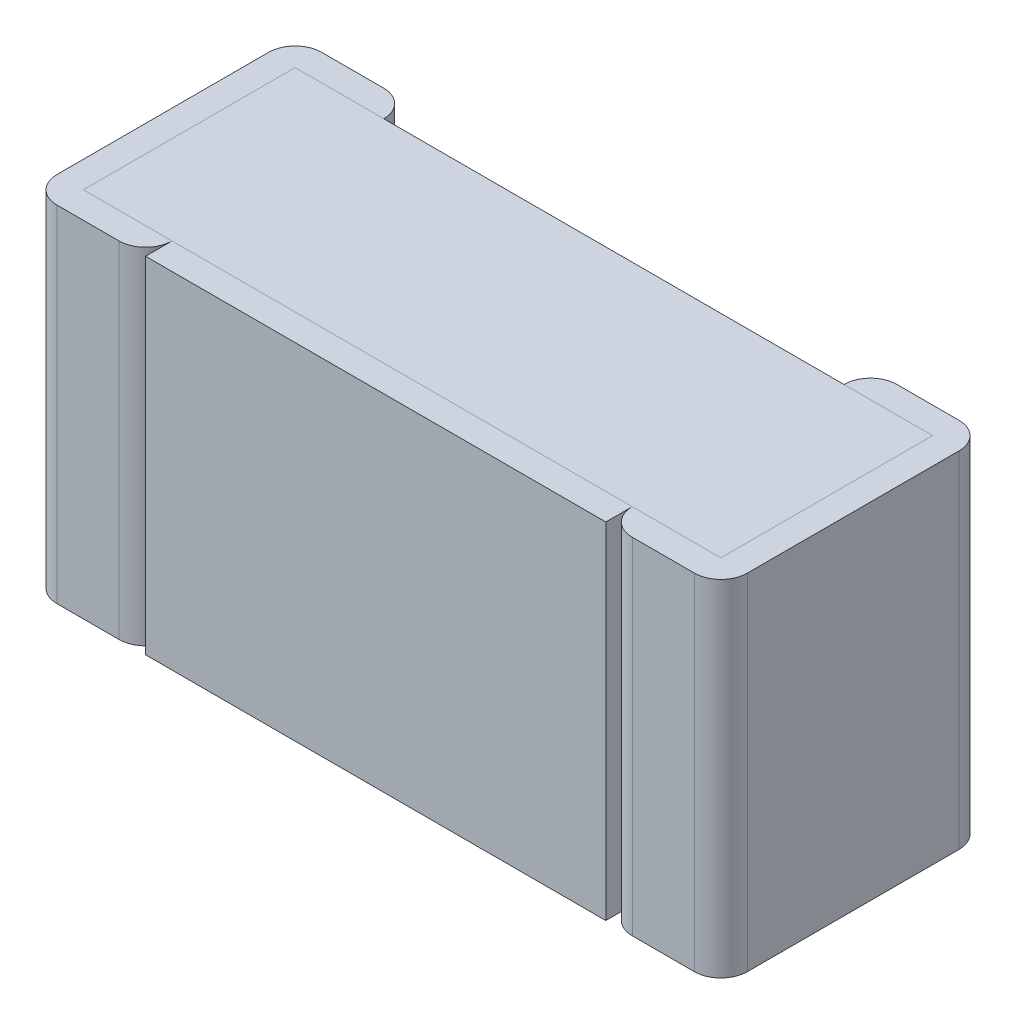
ISO-10303-21;
HEADER;
FILE_DESCRIPTION(('STEP AP214'),'2;1');
FILE_NAME('part.step','',(''),(''),'','','');
FILE_SCHEMA(('AUTOMOTIVE_DESIGN { 1 0 10303 214 1 1 1 1 }'));
ENDSEC;
DATA;
#1=APPLICATION_CONTEXT('core data for automotive mechanical design processes');
#2=APPLICATION_PROTOCOL_DEFINITION('international standard','automotive_design',2000,#1);
#3=PRODUCT_CONTEXT('',#1,'mechanical');
#4=PRODUCT('Part','Part','',(#3));
#5=PRODUCT_RELATED_PRODUCT_CATEGORY('part','',(#4));
#6=PRODUCT_DEFINITION_FORMATION('','',#4);
#7=PRODUCT_DEFINITION_CONTEXT('part definition',#1,'design');
#8=PRODUCT_DEFINITION('design','',#6,#7);
#9=PRODUCT_DEFINITION_SHAPE('','',#8);
#10=(LENGTH_UNIT() NAMED_UNIT(*) SI_UNIT(.MILLI.,.METRE.));
#11=(NAMED_UNIT(*) PLANE_ANGLE_UNIT() SI_UNIT($,.RADIAN.));
#12=(NAMED_UNIT(*) SI_UNIT($,.STERADIAN.) SOLID_ANGLE_UNIT());
#13=UNCERTAINTY_MEASURE_WITH_UNIT(LENGTH_MEASURE(1.E-05),#10,'distance_accuracy_value','');
#14=(GEOMETRIC_REPRESENTATION_CONTEXT(3) GLOBAL_UNCERTAINTY_ASSIGNED_CONTEXT((#13)) GLOBAL_UNIT_ASSIGNED_CONTEXT((#10,
#11,#12)) REPRESENTATION_CONTEXT('',''));
#15=CARTESIAN_POINT('',(0.,0.,0.));
#16=DIRECTION('',(0.,0.,1.));
#17=DIRECTION('',(1.,0.,0.));
#18=AXIS2_PLACEMENT_3D('',#15,#16,#17);
#19=CARTESIAN_POINT('',(-0.3,-0.15,0.));
#20=DIRECTION('',(1.,0.,0.));
#21=DIRECTION('',(0.,0.,1.));
#22=AXIS2_PLACEMENT_3D('',#19,#20,#21);
#23=PLANE('',#22);
#24=DIRECTION('',(0.,1.,0.));
#25=VECTOR('',#24,1.);
#26=CARTESIAN_POINT('',(-0.3,-0.15,0.207));
#27=LINE('',#26,#25);
#28=CARTESIAN_POINT('',(-0.3,-0.15,0.207));
#29=VERTEX_POINT('',#28);
#30=CARTESIAN_POINT('',(-0.3,0.15,0.207));
#31=VERTEX_POINT('',#30);
#32=EDGE_CURVE('E11',#29,#31,#27,.T.);
#33=ORIENTED_EDGE('',*,*,#32,.T.);
#34=DIRECTION('',(0.,0.,1.));
#35=VECTOR('',#34,1.);
#36=CARTESIAN_POINT('',(-0.3,0.15,0.));
#37=LINE('',#36,#35);
#38=CARTESIAN_POINT('',(-0.3,0.15,0.023));
#39=VERTEX_POINT('',#38);
#40=EDGE_CURVE('E25',#39,#31,#37,.T.);
#41=ORIENTED_EDGE('',*,*,#40,.F.);
#42=DIRECTION('',(0.,1.,0.));
#43=VECTOR('',#42,1.);
#44=CARTESIAN_POINT('',(-0.3,-0.15,0.023));
#45=LINE('',#44,#43);
#46=CARTESIAN_POINT('',(-0.3,-0.15,0.023));
#47=VERTEX_POINT('',#46);
#48=EDGE_CURVE('E530',#47,#39,#45,.T.);
#49=ORIENTED_EDGE('',*,*,#48,.F.);
#50=DIRECTION('',(0.,0.,1.));
#51=VECTOR('',#50,1.);
#52=CARTESIAN_POINT('',(-0.3,-0.15,0.));
#53=LINE('',#52,#51);
#54=EDGE_CURVE('E526',#47,#29,#53,.T.);
#55=ORIENTED_EDGE('',*,*,#54,.T.);
#56=EDGE_LOOP('',(#33,#41,#49,#55));
#57=FACE_BOUND('',#56,.T.);
#58=ADVANCED_FACE('F17',(#57),#23,.F.);
#59=CARTESIAN_POINT('',(-0.3,-0.15,0.));
#60=DIRECTION('',(0.,1.,0.));
#61=DIRECTION('',(0.,0.,1.));
#62=AXIS2_PLACEMENT_3D('',#59,#60,#61);
#63=PLANE('',#62);
#64=CARTESIAN_POINT('',(-0.223,-0.15,0.023));
#65=DIRECTION('',(0.,1.,0.));
#66=DIRECTION('',(0.,0.,1.));
#67=AXIS2_PLACEMENT_3D('',#64,#65,#66);
#68=CIRCLE('',#67,0.023);
#69=CARTESIAN_POINT('',(-0.2,-0.15,0.023));
#70=VERTEX_POINT('',#69);
#71=CARTESIAN_POINT('',(-0.223,-0.15,0.));
#72=VERTEX_POINT('',#71);
#73=EDGE_CURVE('E521',#70,#72,#68,.T.);
#74=ORIENTED_EDGE('',*,*,#73,.F.);
#75=DIRECTION('',(1.,0.,0.));
#76=VECTOR('',#75,1.);
#77=CARTESIAN_POINT('',(-0.277,-0.15,0.023));
#78=LINE('',#77,#76);
#79=CARTESIAN_POINT('',(-0.277,-0.15,0.023));
#80=VERTEX_POINT('',#79);
#81=EDGE_CURVE('E516',#80,#70,#78,.T.);
#82=ORIENTED_EDGE('',*,*,#81,.F.);
#83=DIRECTION('',(0.,0.,1.));
#84=VECTOR('',#83,1.);
#85=CARTESIAN_POINT('',(-0.277,-0.15,0.023));
#86=LINE('',#85,#84);
#87=CARTESIAN_POINT('',(-0.277,-0.15,0.207));
#88=VERTEX_POINT('',#87);
#89=EDGE_CURVE('E512',#80,#88,#86,.T.);
#90=ORIENTED_EDGE('',*,*,#89,.T.);
#91=DIRECTION('',(1.,0.,0.));
#92=VECTOR('',#91,1.);
#93=CARTESIAN_POINT('',(-0.277,-0.15,0.207));
#94=LINE('',#93,#92);
#95=CARTESIAN_POINT('',(-0.2,-0.15,0.207));
#96=VERTEX_POINT('',#95);
#97=EDGE_CURVE('E508',#88,#96,#94,.T.);
#98=ORIENTED_EDGE('',*,*,#97,.T.);
#99=CARTESIAN_POINT('',(-0.223,-0.15,0.207));
#100=DIRECTION('',(0.,-1.,0.));
#101=DIRECTION('',(0.,0.,1.));
#102=AXIS2_PLACEMENT_3D('',#99,#100,#101);
#103=CIRCLE('',#102,0.023);
#104=CARTESIAN_POINT('',(-0.223,-0.15,0.23));
#105=VERTEX_POINT('',#104);
#106=EDGE_CURVE('E504',#96,#105,#103,.T.);
#107=ORIENTED_EDGE('',*,*,#106,.T.);
#108=DIRECTION('',(1.,0.,0.));
#109=VECTOR('',#108,1.);
#110=CARTESIAN_POINT('',(-0.3,-0.15,0.23));
#111=LINE('',#110,#109);
#112=CARTESIAN_POINT('',(-0.277,-0.15,0.23));
#113=VERTEX_POINT('',#112);
#114=EDGE_CURVE('E499',#113,#105,#111,.T.);
#115=ORIENTED_EDGE('',*,*,#114,.F.);
#116=CARTESIAN_POINT('',(-0.277,-0.15,0.207));
#117=DIRECTION('',(0.,1.,0.));
#118=DIRECTION('',(0.,0.,1.));
#119=AXIS2_PLACEMENT_3D('',#116,#117,#118);
#120=CIRCLE('',#119,0.023);
#121=EDGE_CURVE('E494',#29,#113,#120,.T.);
#122=ORIENTED_EDGE('',*,*,#121,.F.);
#123=ORIENTED_EDGE('',*,*,#54,.F.);
#124=CARTESIAN_POINT('',(-0.277,-0.15,0.023));
#125=DIRECTION('',(0.,-1.,0.));
#126=DIRECTION('',(0.,0.,1.));
#127=AXIS2_PLACEMENT_3D('',#124,#125,#126);
#128=CIRCLE('',#127,0.023);
#129=CARTESIAN_POINT('',(-0.277,-0.15,0.));
#130=VERTEX_POINT('',#129);
#131=EDGE_CURVE('E490',#47,#130,#128,.T.);
#132=ORIENTED_EDGE('',*,*,#131,.T.);
#133=DIRECTION('',(1.,0.,0.));
#134=VECTOR('',#133,1.);
#135=CARTESIAN_POINT('',(-0.3,-0.15,0.));
#136=LINE('',#135,#134);
#137=EDGE_CURVE('E486',#130,#72,#136,.T.);
#138=ORIENTED_EDGE('',*,*,#137,.T.);
#139=EDGE_LOOP('',(#74,#82,#90,#98,#107,#115,#122,#123,#132,#138));
#140=FACE_BOUND('',#139,.T.);
#141=ADVANCED_FACE('F550',(#140),#63,.F.);
#142=CARTESIAN_POINT('',(-0.3,-0.15,0.));
#143=DIRECTION('',(0.,0.,1.));
#144=DIRECTION('',(1.,0.,0.));
#145=AXIS2_PLACEMENT_3D('',#142,#143,#144);
#146=PLANE('',#145);
#147=DIRECTION('',(0.,1.,0.));
#148=VECTOR('',#147,1.);
#149=CARTESIAN_POINT('',(-0.223,-0.15,0.));
#150=LINE('',#149,#148);
#151=CARTESIAN_POINT('',(-0.223,0.15,0.));
#152=VERTEX_POINT('',#151);
#153=EDGE_CURVE('E481',#72,#152,#150,.T.);
#154=ORIENTED_EDGE('',*,*,#153,.F.);
#155=ORIENTED_EDGE('',*,*,#137,.F.);
#156=DIRECTION('',(0.,1.,0.));
#157=VECTOR('',#156,1.);
#158=CARTESIAN_POINT('',(-0.277,-0.15,0.));
#159=LINE('',#158,#157);
#160=CARTESIAN_POINT('',(-0.277,0.15,0.));
#161=VERTEX_POINT('',#160);
#162=EDGE_CURVE('E477',#130,#161,#159,.T.);
#163=ORIENTED_EDGE('',*,*,#162,.T.);
#164=DIRECTION('',(1.,0.,0.));
#165=VECTOR('',#164,1.);
#166=CARTESIAN_POINT('',(-0.3,0.15,0.));
#167=LINE('',#166,#165);
#168=EDGE_CURVE('E473',#161,#152,#167,.T.);
#169=ORIENTED_EDGE('',*,*,#168,.T.);
#170=EDGE_LOOP('',(#154,#155,#163,#169));
#171=FACE_BOUND('',#170,.T.);
#172=ADVANCED_FACE('F577',(#171),#146,.F.);
#173=CARTESIAN_POINT('',(-0.3,0.15,0.));
#174=DIRECTION('',(0.,1.,0.));
#175=DIRECTION('',(0.,0.,1.));
#176=AXIS2_PLACEMENT_3D('',#173,#174,#175);
#177=PLANE('',#176);
#178=ORIENTED_EDGE('',*,*,#168,.F.);
#179=CARTESIAN_POINT('',(-0.277,0.15,0.023));
#180=DIRECTION('',(0.,-1.,0.));
#181=DIRECTION('',(0.,0.,1.));
#182=AXIS2_PLACEMENT_3D('',#179,#180,#181);
#183=CIRCLE('',#182,0.023);
#184=EDGE_CURVE('E468',#39,#161,#183,.T.);
#185=ORIENTED_EDGE('',*,*,#184,.F.);
#186=ORIENTED_EDGE('',*,*,#40,.T.);
#187=CARTESIAN_POINT('',(-0.277,0.15,0.207));
#188=DIRECTION('',(0.,1.,0.));
#189=DIRECTION('',(0.,0.,1.));
#190=AXIS2_PLACEMENT_3D('',#187,#188,#189);
#191=CIRCLE('',#190,0.023);
#192=CARTESIAN_POINT('',(-0.277,0.15,0.23));
#193=VERTEX_POINT('',#192);
#194=EDGE_CURVE('E464',#31,#193,#191,.T.);
#195=ORIENTED_EDGE('',*,*,#194,.T.);
#196=DIRECTION('',(1.,0.,0.));
#197=VECTOR('',#196,1.);
#198=CARTESIAN_POINT('',(-0.3,0.15,0.23));
#199=LINE('',#198,#197);
#200=CARTESIAN_POINT('',(-0.223,0.15,0.23));
#201=VERTEX_POINT('',#200);
#202=EDGE_CURVE('E460',#193,#201,#199,.T.);
#203=ORIENTED_EDGE('',*,*,#202,.T.);
#204=CARTESIAN_POINT('',(-0.223,0.15,0.207));
#205=DIRECTION('',(0.,-1.,0.));
#206=DIRECTION('',(0.,0.,1.));
#207=AXIS2_PLACEMENT_3D('',#204,#205,#206);
#208=CIRCLE('',#207,0.023);
#209=CARTESIAN_POINT('',(-0.2,0.15,0.207));
#210=VERTEX_POINT('',#209);
#211=EDGE_CURVE('E455',#210,#201,#208,.T.);
#212=ORIENTED_EDGE('',*,*,#211,.F.);
#213=DIRECTION('',(1.,0.,0.));
#214=VECTOR('',#213,1.);
#215=CARTESIAN_POINT('',(-0.277,0.15,0.207));
#216=LINE('',#215,#214);
#217=CARTESIAN_POINT('',(-0.277,0.15,0.207));
#218=VERTEX_POINT('',#217);
#219=EDGE_CURVE('E450',#218,#210,#216,.T.);
#220=ORIENTED_EDGE('',*,*,#219,.F.);
#221=DIRECTION('',(0.,0.,1.));
#222=VECTOR('',#221,1.);
#223=CARTESIAN_POINT('',(-0.277,0.15,0.023));
#224=LINE('',#223,#222);
#225=CARTESIAN_POINT('',(-0.277,0.15,0.023));
#226=VERTEX_POINT('',#225);
#227=EDGE_CURVE('E445',#226,#218,#224,.T.);
#228=ORIENTED_EDGE('',*,*,#227,.F.);
#229=DIRECTION('',(1.,0.,0.));
#230=VECTOR('',#229,1.);
#231=CARTESIAN_POINT('',(-0.277,0.15,0.023));
#232=LINE('',#231,#230);
#233=CARTESIAN_POINT('',(-0.2,0.15,0.023));
#234=VERTEX_POINT('',#233);
#235=EDGE_CURVE('E441',#226,#234,#232,.T.);
#236=ORIENTED_EDGE('',*,*,#235,.T.);
#237=CARTESIAN_POINT('',(-0.223,0.15,0.023));
#238=DIRECTION('',(0.,1.,0.));
#239=DIRECTION('',(0.,0.,1.));
#240=AXIS2_PLACEMENT_3D('',#237,#238,#239);
#241=CIRCLE('',#240,0.023);
#242=EDGE_CURVE('E436',#234,#152,#241,.T.);
#243=ORIENTED_EDGE('',*,*,#242,.T.);
#244=EDGE_LOOP('',(#178,#185,#186,#195,#203,#212,#220,#228,#236,#243));
#245=FACE_BOUND('',#244,.T.);
#246=ADVANCED_FACE('F541',(#245),#177,.T.);
#247=CARTESIAN_POINT('',(-0.223,-0.15,0.023));
#248=DIRECTION('',(0.,1.,0.));
#249=DIRECTION('',(-0.707106781186547,0.,0.707106781186548));
#250=AXIS2_PLACEMENT_3D('',#247,#248,#249);
#251=CYLINDRICAL_SURFACE('',#250,0.023);
#252=ORIENTED_EDGE('',*,*,#73,.T.);
#253=ORIENTED_EDGE('',*,*,#153,.T.);
#254=ORIENTED_EDGE('',*,*,#242,.F.);
#255=DIRECTION('',(0.,1.,0.));
#256=VECTOR('',#255,1.);
#257=CARTESIAN_POINT('',(-0.2,-0.15,0.023));
#258=LINE('',#257,#256);
#259=EDGE_CURVE('E431',#70,#234,#258,.T.);
#260=ORIENTED_EDGE('',*,*,#259,.F.);
#261=EDGE_LOOP('',(#252,#253,#254,#260));
#262=FACE_BOUND('',#261,.T.);
#263=ADVANCED_FACE('F573',(#262),#251,.T.);
#264=CARTESIAN_POINT('',(-0.277,-0.15,0.023));
#265=DIRECTION('',(0.,0.,1.));
#266=DIRECTION('',(1.,0.,0.));
#267=AXIS2_PLACEMENT_3D('',#264,#265,#266);
#268=PLANE('',#267);
#269=DIRECTION('',(1.,0.,0.));
#270=VECTOR('',#269,1.);
#271=CARTESIAN_POINT('',(-0.277,0.15,0.023));
#272=LINE('',#271,#270);
#273=CARTESIAN_POINT('',(0.2,0.15,0.023));
#274=VERTEX_POINT('',#273);
#275=EDGE_CURVE('E427',#234,#274,#272,.T.);
#276=ORIENTED_EDGE('',*,*,#275,.T.);
#277=DIRECTION('',(0.,1.,0.));
#278=VECTOR('',#277,1.);
#279=CARTESIAN_POINT('',(0.2,-0.15,0.023));
#280=LINE('',#279,#278);
#281=CARTESIAN_POINT('',(0.2,-0.15,0.023));
#282=VERTEX_POINT('',#281);
#283=EDGE_CURVE('E423',#282,#274,#280,.T.);
#284=ORIENTED_EDGE('',*,*,#283,.F.);
#285=DIRECTION('',(1.,0.,0.));
#286=VECTOR('',#285,1.);
#287=CARTESIAN_POINT('',(-0.277,-0.15,0.023));
#288=LINE('',#287,#286);
#289=EDGE_CURVE('E419',#70,#282,#288,.T.);
#290=ORIENTED_EDGE('',*,*,#289,.F.);
#291=ORIENTED_EDGE('',*,*,#259,.T.);
#292=EDGE_LOOP('',(#276,#284,#290,#291));
#293=FACE_BOUND('',#292,.T.);
#294=ADVANCED_FACE('F571',(#293),#268,.F.);
#295=CARTESIAN_POINT('',(-0.277,-0.15,0.023));
#296=DIRECTION('',(0.,1.,0.));
#297=DIRECTION('',(0.,0.,1.));
#298=AXIS2_PLACEMENT_3D('',#295,#296,#297);
#299=PLANE('',#298);
#300=ORIENTED_EDGE('',*,*,#289,.T.);
#301=DIRECTION('',(1.,0.,0.));
#302=VECTOR('',#301,1.);
#303=CARTESIAN_POINT('',(-0.277,-0.15,0.023));
#304=LINE('',#303,#302);
#305=CARTESIAN_POINT('',(0.277,-0.15,0.023));
#306=VERTEX_POINT('',#305);
#307=EDGE_CURVE('E170',#282,#306,#304,.T.);
#308=ORIENTED_EDGE('',*,*,#307,.T.);
#309=DIRECTION('',(0.,0.,1.));
#310=VECTOR('',#309,1.);
#311=CARTESIAN_POINT('',(0.277,-0.15,0.023));
#312=LINE('',#311,#310);
#313=CARTESIAN_POINT('',(0.277,-0.15,0.207));
#314=VERTEX_POINT('',#313);
#315=EDGE_CURVE('E412',#306,#314,#312,.T.);
#316=ORIENTED_EDGE('',*,*,#315,.T.);
#317=DIRECTION('',(1.,0.,0.));
#318=VECTOR('',#317,1.);
#319=CARTESIAN_POINT('',(-0.277,-0.15,0.207));
#320=LINE('',#319,#318);
#321=CARTESIAN_POINT('',(0.2,-0.15,0.207));
#322=VERTEX_POINT('',#321);
#323=EDGE_CURVE('E407',#322,#314,#320,.T.);
#324=ORIENTED_EDGE('',*,*,#323,.F.);
#325=DIRECTION('',(1.,0.,0.));
#326=VECTOR('',#325,1.);
#327=CARTESIAN_POINT('',(-0.2,-0.15,0.207));
#328=LINE('',#327,#326);
#329=EDGE_CURVE('E402',#96,#322,#328,.T.);
#330=ORIENTED_EDGE('',*,*,#329,.F.);
#331=ORIENTED_EDGE('',*,*,#97,.F.);
#332=ORIENTED_EDGE('',*,*,#89,.F.);
#333=ORIENTED_EDGE('',*,*,#81,.T.);
#334=EDGE_LOOP('',(#300,#308,#316,#324,#330,#331,#332,#333));
#335=FACE_BOUND('',#334,.T.);
#336=ADVANCED_FACE('F581',(#335),#299,.F.);
#337=CARTESIAN_POINT('',(-0.2,-0.15,0.207));
#338=DIRECTION('',(0.,1.,0.));
#339=DIRECTION('',(0.,0.,1.));
#340=AXIS2_PLACEMENT_3D('',#337,#338,#339);
#341=PLANE('',#340);
#342=DIRECTION('',(0.,0.,1.));
#343=VECTOR('',#342,1.);
#344=CARTESIAN_POINT('',(0.2,-0.15,0.207));
#345=LINE('',#344,#343);
#346=CARTESIAN_POINT('',(0.2,-0.15,0.23));
#347=VERTEX_POINT('',#346);
#348=EDGE_CURVE('E398',#322,#347,#345,.T.);
#349=ORIENTED_EDGE('',*,*,#348,.T.);
#350=DIRECTION('',(1.,0.,0.));
#351=VECTOR('',#350,1.);
#352=CARTESIAN_POINT('',(-0.2,-0.15,0.23));
#353=LINE('',#352,#351);
#354=CARTESIAN_POINT('',(-0.2,-0.15,0.23));
#355=VERTEX_POINT('',#354);
#356=EDGE_CURVE('E393',#355,#347,#353,.T.);
#357=ORIENTED_EDGE('',*,*,#356,.F.);
#358=DIRECTION('',(0.,0.,1.));
#359=VECTOR('',#358,1.);
#360=CARTESIAN_POINT('',(-0.2,-0.15,0.207));
#361=LINE('',#360,#359);
#362=EDGE_CURVE('E389',#96,#355,#361,.T.);
#363=ORIENTED_EDGE('',*,*,#362,.F.);
#364=ORIENTED_EDGE('',*,*,#329,.T.);
#365=EDGE_LOOP('',(#349,#357,#363,#364));
#366=FACE_BOUND('',#365,.T.);
#367=ADVANCED_FACE('F366',(#366),#341,.F.);
#368=CARTESIAN_POINT('',(-0.2,-0.15,0.207));
#369=DIRECTION('',(1.,0.,0.));
#370=DIRECTION('',(0.,0.,1.));
#371=AXIS2_PLACEMENT_3D('',#368,#369,#370);
#372=PLANE('',#371);
#373=DIRECTION('',(0.,1.,0.));
#374=VECTOR('',#373,1.);
#375=CARTESIAN_POINT('',(-0.2,-0.15,0.23));
#376=LINE('',#375,#374);
#377=CARTESIAN_POINT('',(-0.2,0.15,0.23));
#378=VERTEX_POINT('',#377);
#379=EDGE_CURVE('E385',#355,#378,#376,.T.);
#380=ORIENTED_EDGE('',*,*,#379,.T.);
#381=DIRECTION('',(0.,0.,1.));
#382=VECTOR('',#381,1.);
#383=CARTESIAN_POINT('',(-0.2,0.15,0.207));
#384=LINE('',#383,#382);
#385=EDGE_CURVE('E382',#210,#378,#384,.T.);
#386=ORIENTED_EDGE('',*,*,#385,.F.);
#387=CARTESIAN_POINT('',(-0.2,-0.15,0.207));
#388=DIRECTION('',(0.,1.,0.));
#389=VECTOR('',#388,1.);
#390=LINE('',#387,#389);
#391=EDGE_CURVE('E341',#96,#210,#390,.T.);
#392=ORIENTED_EDGE('',*,*,#391,.F.);
#393=ORIENTED_EDGE('',*,*,#362,.T.);
#394=EDGE_LOOP('',(#380,#386,#392,#393));
#395=FACE_BOUND('',#394,.T.);
#396=ADVANCED_FACE('F361',(#395),#372,.F.);
#397=CARTESIAN_POINT('',(-0.223,-0.15,0.207));
#398=DIRECTION('',(0.,1.,0.));
#399=DIRECTION('',(-0.707106781186547,0.,-0.707106781186548));
#400=AXIS2_PLACEMENT_3D('',#397,#398,#399);
#401=CYLINDRICAL_SURFACE('',#400,0.023);
#402=ORIENTED_EDGE('',*,*,#391,.T.);
#403=ORIENTED_EDGE('',*,*,#211,.T.);
#404=DIRECTION('',(0.,1.,0.));
#405=VECTOR('',#404,1.);
#406=CARTESIAN_POINT('',(-0.223,-0.15,0.23));
#407=LINE('',#406,#405);
#408=EDGE_CURVE('E336',#105,#201,#407,.T.);
#409=ORIENTED_EDGE('',*,*,#408,.F.);
#410=ORIENTED_EDGE('',*,*,#106,.F.);
#411=EDGE_LOOP('',(#402,#403,#409,#410));
#412=FACE_BOUND('',#411,.T.);
#413=ADVANCED_FACE('F350',(#412),#401,.T.);
#414=CARTESIAN_POINT('',(-0.3,-0.15,0.23));
#415=DIRECTION('',(0.,0.,1.));
#416=DIRECTION('',(1.,0.,0.));
#417=AXIS2_PLACEMENT_3D('',#414,#415,#416);
#418=PLANE('',#417);
#419=ORIENTED_EDGE('',*,*,#202,.F.);
#420=DIRECTION('',(0.,1.,0.));
#421=VECTOR('',#420,1.);
#422=CARTESIAN_POINT('',(-0.277,-0.15,0.23));
#423=LINE('',#422,#421);
#424=EDGE_CURVE('E331',#113,#193,#423,.T.);
#425=ORIENTED_EDGE('',*,*,#424,.F.);
#426=ORIENTED_EDGE('',*,*,#114,.T.);
#427=ORIENTED_EDGE('',*,*,#408,.T.);
#428=EDGE_LOOP('',(#419,#425,#426,#427));
#429=FACE_BOUND('',#428,.T.);
#430=ADVANCED_FACE('F360',(#429),#418,.T.);
#431=CARTESIAN_POINT('',(-0.277,-0.15,0.207));
#432=DIRECTION('',(0.,1.,0.));
#433=DIRECTION('',(0.707106781186547,0.,-0.707106781186548));
#434=AXIS2_PLACEMENT_3D('',#431,#432,#433);
#435=CYLINDRICAL_SURFACE('',#434,0.023);
#436=ORIENTED_EDGE('',*,*,#121,.T.);
#437=ORIENTED_EDGE('',*,*,#424,.T.);
#438=ORIENTED_EDGE('',*,*,#194,.F.);
#439=ORIENTED_EDGE('',*,*,#32,.F.);
#440=EDGE_LOOP('',(#436,#437,#438,#439));
#441=FACE_BOUND('',#440,.T.);
#442=ADVANCED_FACE('F553',(#441),#435,.T.);
#443=CARTESIAN_POINT('',(-0.2,0.15,0.207));
#444=DIRECTION('',(0.,1.,0.));
#445=DIRECTION('',(0.,0.,1.));
#446=AXIS2_PLACEMENT_3D('',#443,#444,#445);
#447=PLANE('',#446);
#448=DIRECTION('',(1.,0.,0.));
#449=VECTOR('',#448,1.);
#450=CARTESIAN_POINT('',(-0.2,0.15,0.207));
#451=LINE('',#450,#449);
#452=CARTESIAN_POINT('',(0.2,0.15,0.207));
#453=VERTEX_POINT('',#452);
#454=EDGE_CURVE('E326',#210,#453,#451,.T.);
#455=ORIENTED_EDGE('',*,*,#454,.F.);
#456=ORIENTED_EDGE('',*,*,#385,.T.);
#457=DIRECTION('',(1.,0.,0.));
#458=VECTOR('',#457,1.);
#459=CARTESIAN_POINT('',(-0.2,0.15,0.23));
#460=LINE('',#459,#458);
#461=CARTESIAN_POINT('',(0.2,0.15,0.23));
#462=VERTEX_POINT('',#461);
#463=EDGE_CURVE('E322',#378,#462,#460,.T.);
#464=ORIENTED_EDGE('',*,*,#463,.T.);
#465=DIRECTION('',(0.,0.,1.));
#466=VECTOR('',#465,1.);
#467=CARTESIAN_POINT('',(0.2,0.15,0.207));
#468=LINE('',#467,#466);
#469=EDGE_CURVE('E320',#453,#462,#468,.T.);
#470=ORIENTED_EDGE('',*,*,#469,.F.);
#471=EDGE_LOOP('',(#455,#456,#464,#470));
#472=FACE_BOUND('',#471,.T.);
#473=ADVANCED_FACE('F299',(#472),#447,.T.);
#474=CARTESIAN_POINT('',(0.2,-0.15,0.207));
#475=DIRECTION('',(1.,0.,0.));
#476=DIRECTION('',(0.,0.,1.));
#477=AXIS2_PLACEMENT_3D('',#474,#475,#476);
#478=PLANE('',#477);
#479=ORIENTED_EDGE('',*,*,#348,.F.);
#480=CARTESIAN_POINT('',(0.2,-0.15,0.207));
#481=DIRECTION('',(0.,1.,0.));
#482=VECTOR('',#481,1.);
#483=LINE('',#480,#482);
#484=EDGE_CURVE('E318',#322,#453,#483,.T.);
#485=ORIENTED_EDGE('',*,*,#484,.T.);
#486=ORIENTED_EDGE('',*,*,#469,.T.);
#487=DIRECTION('',(0.,1.,0.));
#488=VECTOR('',#487,1.);
#489=CARTESIAN_POINT('',(0.2,-0.15,0.23));
#490=LINE('',#489,#488);
#491=EDGE_CURVE('E587',#347,#462,#490,.T.);
#492=ORIENTED_EDGE('',*,*,#491,.F.);
#493=EDGE_LOOP('',(#479,#485,#486,#492));
#494=FACE_BOUND('',#493,.T.);
#495=ADVANCED_FACE('F294',(#494),#478,.T.);
#496=CARTESIAN_POINT('',(-0.2,-0.15,0.23));
#497=DIRECTION('',(0.,0.,1.));
#498=DIRECTION('',(1.,0.,0.));
#499=AXIS2_PLACEMENT_3D('',#496,#497,#498);
#500=PLANE('',#499);
#501=ORIENTED_EDGE('',*,*,#379,.F.);
#502=ORIENTED_EDGE('',*,*,#356,.T.);
#503=ORIENTED_EDGE('',*,*,#491,.T.);
#504=ORIENTED_EDGE('',*,*,#463,.F.);
#505=EDGE_LOOP('',(#501,#502,#503,#504));
#506=FACE_BOUND('',#505,.T.);
#507=ADVANCED_FACE('F289',(#506),#500,.T.);
#508=CARTESIAN_POINT('',(0.223,-0.15,0.207));
#509=DIRECTION('',(0.,1.,0.));
#510=DIRECTION('',(0.707106781186547,0.,-0.707106781186548));
#511=AXIS2_PLACEMENT_3D('',#508,#509,#510);
#512=CYLINDRICAL_SURFACE('',#511,0.023);
#513=CARTESIAN_POINT('',(0.223,-0.15,0.207));
#514=DIRECTION('',(0.,1.,0.));
#515=DIRECTION('',(0.,0.,1.));
#516=AXIS2_PLACEMENT_3D('',#513,#514,#515);
#517=CIRCLE('',#516,0.023);
#518=CARTESIAN_POINT('',(0.223,-0.15,0.23));
#519=VERTEX_POINT('',#518);
#520=EDGE_CURVE('E588',#322,#519,#517,.T.);
#521=ORIENTED_EDGE('',*,*,#520,.T.);
#522=DIRECTION('',(0.,1.,0.));
#523=VECTOR('',#522,1.);
#524=CARTESIAN_POINT('',(0.223,-0.15,0.23));
#525=LINE('',#524,#523);
#526=CARTESIAN_POINT('',(0.223,0.15,0.23));
#527=VERTEX_POINT('',#526);
#528=EDGE_CURVE('E593',#519,#527,#525,.T.);
#529=ORIENTED_EDGE('',*,*,#528,.T.);
#530=CARTESIAN_POINT('',(0.223,0.15,0.207));
#531=DIRECTION('',(0.,1.,0.));
#532=DIRECTION('',(0.,0.,1.));
#533=AXIS2_PLACEMENT_3D('',#530,#531,#532);
#534=CIRCLE('',#533,0.023);
#535=EDGE_CURVE('E269',#453,#527,#534,.T.);
#536=ORIENTED_EDGE('',*,*,#535,.F.);
#537=ORIENTED_EDGE('',*,*,#484,.F.);
#538=EDGE_LOOP('',(#521,#529,#536,#537));
#539=FACE_BOUND('',#538,.T.);
#540=ADVANCED_FACE('F278',(#539),#512,.T.);
#541=CARTESIAN_POINT('',(0.2,0.15,0.));
#542=DIRECTION('',(0.,1.,0.));
#543=DIRECTION('',(0.,0.,1.));
#544=AXIS2_PLACEMENT_3D('',#541,#542,#543);
#545=PLANE('',#544);
#546=DIRECTION('',(1.,0.,0.));
#547=VECTOR('',#546,1.);
#548=CARTESIAN_POINT('',(0.2,0.15,0.));
#549=LINE('',#548,#547);
#550=CARTESIAN_POINT('',(0.223,0.15,0.));
#551=VERTEX_POINT('',#550);
#552=CARTESIAN_POINT('',(0.277,0.15,0.));
#553=VERTEX_POINT('',#552);
#554=EDGE_CURVE('E265',#551,#553,#549,.T.);
#555=ORIENTED_EDGE('',*,*,#554,.F.);
#556=CARTESIAN_POINT('',(0.223,0.15,0.023));
#557=DIRECTION('',(0.,-1.,0.));
#558=DIRECTION('',(0.,0.,1.));
#559=AXIS2_PLACEMENT_3D('',#556,#557,#558);
#560=CIRCLE('',#559,0.023);
#561=EDGE_CURVE('E188',#274,#551,#560,.T.);
#562=ORIENTED_EDGE('',*,*,#561,.F.);
#563=DIRECTION('',(1.,0.,0.));
#564=VECTOR('',#563,1.);
#565=CARTESIAN_POINT('',(-0.277,0.15,0.023));
#566=LINE('',#565,#564);
#567=CARTESIAN_POINT('',(0.277,0.15,0.023));
#568=VERTEX_POINT('',#567);
#569=EDGE_CURVE('E258',#274,#568,#566,.T.);
#570=ORIENTED_EDGE('',*,*,#569,.T.);
#571=DIRECTION('',(0.,0.,1.));
#572=VECTOR('',#571,1.);
#573=CARTESIAN_POINT('',(0.277,0.15,0.023));
#574=LINE('',#573,#572);
#575=CARTESIAN_POINT('',(0.277,0.15,0.207));
#576=VERTEX_POINT('',#575);
#577=EDGE_CURVE('E254',#568,#576,#574,.T.);
#578=ORIENTED_EDGE('',*,*,#577,.T.);
#579=DIRECTION('',(1.,0.,0.));
#580=VECTOR('',#579,1.);
#581=CARTESIAN_POINT('',(-0.277,0.15,0.207));
#582=LINE('',#581,#580);
#583=EDGE_CURVE('E249',#453,#576,#582,.T.);
#584=ORIENTED_EDGE('',*,*,#583,.F.);
#585=ORIENTED_EDGE('',*,*,#535,.T.);
#586=DIRECTION('',(1.,0.,0.));
#587=VECTOR('',#586,1.);
#588=CARTESIAN_POINT('',(0.2,0.15,0.23));
#589=LINE('',#588,#587);
#590=CARTESIAN_POINT('',(0.277,0.15,0.23));
#591=VERTEX_POINT('',#590);
#592=EDGE_CURVE('E245',#527,#591,#589,.T.);
#593=ORIENTED_EDGE('',*,*,#592,.T.);
#594=CARTESIAN_POINT('',(0.277,0.15,0.207));
#595=DIRECTION('',(0.,-1.,0.));
#596=DIRECTION('',(0.,0.,1.));
#597=AXIS2_PLACEMENT_3D('',#594,#595,#596);
#598=CIRCLE('',#597,0.023);
#599=CARTESIAN_POINT('',(0.3,0.15,0.207));
#600=VERTEX_POINT('',#599);
#601=EDGE_CURVE('E240',#600,#591,#598,.T.);
#602=ORIENTED_EDGE('',*,*,#601,.F.);
#603=DIRECTION('',(0.,0.,1.));
#604=VECTOR('',#603,1.);
#605=CARTESIAN_POINT('',(0.3,0.15,0.));
#606=LINE('',#605,#604);
#607=CARTESIAN_POINT('',(0.3,0.15,0.023));
#608=VERTEX_POINT('',#607);
#609=EDGE_CURVE('E235',#608,#600,#606,.T.);
#610=ORIENTED_EDGE('',*,*,#609,.F.);
#611=CARTESIAN_POINT('',(0.277,0.15,0.023));
#612=DIRECTION('',(0.,1.,0.));
#613=DIRECTION('',(0.,0.,1.));
#614=AXIS2_PLACEMENT_3D('',#611,#612,#613);
#615=CIRCLE('',#614,0.023);
#616=EDGE_CURVE('E231',#608,#553,#615,.T.);
#617=ORIENTED_EDGE('',*,*,#616,.T.);
#618=EDGE_LOOP('',(#555,#562,#570,#578,#584,#585,#593,#602,#610,#617));
#619=FACE_BOUND('',#618,.T.);
#620=ADVANCED_FACE('F288',(#619),#545,.T.);
#621=CARTESIAN_POINT('',(0.277,-0.15,0.023));
#622=DIRECTION('',(0.,1.,0.));
#623=DIRECTION('',(-0.707106781186547,0.,0.707106781186548));
#624=AXIS2_PLACEMENT_3D('',#621,#622,#623);
#625=CYLINDRICAL_SURFACE('',#624,0.023);
#626=CARTESIAN_POINT('',(0.277,-0.15,0.023));
#627=DIRECTION('',(0.,1.,0.));
#628=DIRECTION('',(0.,0.,1.));
#629=AXIS2_PLACEMENT_3D('',#626,#627,#628);
#630=CIRCLE('',#629,0.023);
#631=CARTESIAN_POINT('',(0.3,-0.15,0.023));
#632=VERTEX_POINT('',#631);
#633=CARTESIAN_POINT('',(0.277,-0.15,0.));
#634=VERTEX_POINT('',#633);
#635=EDGE_CURVE('E227',#632,#634,#630,.T.);
#636=ORIENTED_EDGE('',*,*,#635,.T.);
#637=DIRECTION('',(0.,1.,0.));
#638=VECTOR('',#637,1.);
#639=CARTESIAN_POINT('',(0.277,-0.15,0.));
#640=LINE('',#639,#638);
#641=EDGE_CURVE('E184',#634,#553,#640,.T.);
#642=ORIENTED_EDGE('',*,*,#641,.T.);
#643=ORIENTED_EDGE('',*,*,#616,.F.);
#644=DIRECTION('',(0.,1.,0.));
#645=VECTOR('',#644,1.);
#646=CARTESIAN_POINT('',(0.3,-0.15,0.023));
#647=LINE('',#646,#645);
#648=EDGE_CURVE('E219',#632,#608,#647,.T.);
#649=ORIENTED_EDGE('',*,*,#648,.F.);
#650=EDGE_LOOP('',(#636,#642,#643,#649));
#651=FACE_BOUND('',#650,.T.);
#652=ADVANCED_FACE('F606',(#651),#625,.T.);
#653=CARTESIAN_POINT('',(0.3,-0.15,0.));
#654=DIRECTION('',(1.,0.,0.));
#655=DIRECTION('',(0.,0.,1.));
#656=AXIS2_PLACEMENT_3D('',#653,#654,#655);
#657=PLANE('',#656);
#658=DIRECTION('',(0.,0.,1.));
#659=VECTOR('',#658,1.);
#660=CARTESIAN_POINT('',(0.3,-0.15,0.));
#661=LINE('',#660,#659);
#662=CARTESIAN_POINT('',(0.3,-0.15,0.207));
#663=VERTEX_POINT('',#662);
#664=EDGE_CURVE('E214',#632,#663,#661,.T.);
#665=ORIENTED_EDGE('',*,*,#664,.F.);
#666=ORIENTED_EDGE('',*,*,#648,.T.);
#667=ORIENTED_EDGE('',*,*,#609,.T.);
#668=DIRECTION('',(0.,1.,0.));
#669=VECTOR('',#668,1.);
#670=CARTESIAN_POINT('',(0.3,-0.15,0.207));
#671=LINE('',#670,#669);
#672=EDGE_CURVE('E209',#663,#600,#671,.T.);
#673=ORIENTED_EDGE('',*,*,#672,.F.);
#674=EDGE_LOOP('',(#665,#666,#667,#673));
#675=FACE_BOUND('',#674,.T.);
#676=ADVANCED_FACE('F610',(#675),#657,.T.);
#677=CARTESIAN_POINT('',(0.277,-0.15,0.207));
#678=DIRECTION('',(0.,1.,0.));
#679=DIRECTION('',(-0.707106781186547,0.,-0.707106781186548));
#680=AXIS2_PLACEMENT_3D('',#677,#678,#679);
#681=CYLINDRICAL_SURFACE('',#680,0.023);
#682=ORIENTED_EDGE('',*,*,#672,.T.);
#683=ORIENTED_EDGE('',*,*,#601,.T.);
#684=DIRECTION('',(0.,1.,0.));
#685=VECTOR('',#684,1.);
#686=CARTESIAN_POINT('',(0.277,-0.15,0.23));
#687=LINE('',#686,#685);
#688=CARTESIAN_POINT('',(0.277,-0.15,0.23));
#689=VERTEX_POINT('',#688);
#690=EDGE_CURVE('E204',#689,#591,#687,.T.);
#691=ORIENTED_EDGE('',*,*,#690,.F.);
#692=CARTESIAN_POINT('',(0.277,-0.15,0.207));
#693=DIRECTION('',(0.,-1.,0.));
#694=DIRECTION('',(0.,0.,1.));
#695=AXIS2_PLACEMENT_3D('',#692,#693,#694);
#696=CIRCLE('',#695,0.023);
#697=EDGE_CURVE('E199',#663,#689,#696,.T.);
#698=ORIENTED_EDGE('',*,*,#697,.F.);
#699=EDGE_LOOP('',(#682,#683,#691,#698));
#700=FACE_BOUND('',#699,.T.);
#701=ADVANCED_FACE('F612',(#700),#681,.T.);
#702=CARTESIAN_POINT('',(0.2,-0.15,0.));
#703=DIRECTION('',(0.,1.,0.));
#704=DIRECTION('',(0.,0.,1.));
#705=AXIS2_PLACEMENT_3D('',#702,#703,#704);
#706=PLANE('',#705);
#707=ORIENTED_EDGE('',*,*,#635,.F.);
#708=ORIENTED_EDGE('',*,*,#664,.T.);
#709=ORIENTED_EDGE('',*,*,#697,.T.);
#710=DIRECTION('',(1.,0.,0.));
#711=VECTOR('',#710,1.);
#712=CARTESIAN_POINT('',(0.2,-0.15,0.23));
#713=LINE('',#712,#711);
#714=EDGE_CURVE('E175',#519,#689,#713,.T.);
#715=ORIENTED_EDGE('',*,*,#714,.F.);
#716=ORIENTED_EDGE('',*,*,#520,.F.);
#717=ORIENTED_EDGE('',*,*,#323,.T.);
#718=ORIENTED_EDGE('',*,*,#315,.F.);
#719=ORIENTED_EDGE('',*,*,#307,.F.);
#720=CARTESIAN_POINT('',(0.223,-0.15,0.023));
#721=DIRECTION('',(0.,-1.,0.));
#722=DIRECTION('',(0.,0.,1.));
#723=AXIS2_PLACEMENT_3D('',#720,#721,#722);
#724=CIRCLE('',#723,0.023);
#725=CARTESIAN_POINT('',(0.223,-0.15,0.));
#726=VERTEX_POINT('',#725);
#727=EDGE_CURVE('E163',#282,#726,#724,.T.);
#728=ORIENTED_EDGE('',*,*,#727,.T.);
#729=DIRECTION('',(1.,0.,0.));
#730=VECTOR('',#729,1.);
#731=CARTESIAN_POINT('',(0.2,-0.15,0.));
#732=LINE('',#731,#730);
#733=EDGE_CURVE('E167',#726,#634,#732,.T.);
#734=ORIENTED_EDGE('',*,*,#733,.T.);
#735=EDGE_LOOP('',(#707,#708,#709,#715,#716,#717,#718,#719,#728,#734));
#736=FACE_BOUND('',#735,.T.);
#737=ADVANCED_FACE('F166',(#736),#706,.F.);
#738=CARTESIAN_POINT('',(0.2,-0.15,0.));
#739=DIRECTION('',(0.,0.,1.));
#740=DIRECTION('',(1.,0.,0.));
#741=AXIS2_PLACEMENT_3D('',#738,#739,#740);
#742=PLANE('',#741);
#743=ORIENTED_EDGE('',*,*,#641,.F.);
#744=ORIENTED_EDGE('',*,*,#733,.F.);
#745=DIRECTION('',(0.,1.,0.));
#746=VECTOR('',#745,1.);
#747=CARTESIAN_POINT('',(0.223,-0.15,0.));
#748=LINE('',#747,#746);
#749=EDGE_CURVE('E181',#726,#551,#748,.T.);
#750=ORIENTED_EDGE('',*,*,#749,.T.);
#751=ORIENTED_EDGE('',*,*,#554,.T.);
#752=EDGE_LOOP('',(#743,#744,#750,#751));
#753=FACE_BOUND('',#752,.T.);
#754=ADVANCED_FACE('F179',(#753),#742,.F.);
#755=CARTESIAN_POINT('',(0.223,-0.15,0.023));
#756=DIRECTION('',(0.,1.,0.));
#757=DIRECTION('',(0.707106781186547,0.,0.707106781186548));
#758=AXIS2_PLACEMENT_3D('',#755,#756,#757);
#759=CYLINDRICAL_SURFACE('',#758,0.023);
#760=ORIENTED_EDGE('',*,*,#283,.T.);
#761=ORIENTED_EDGE('',*,*,#561,.T.);
#762=ORIENTED_EDGE('',*,*,#749,.F.);
#763=ORIENTED_EDGE('',*,*,#727,.F.);
#764=EDGE_LOOP('',(#760,#761,#762,#763));
#765=FACE_BOUND('',#764,.T.);
#766=ADVANCED_FACE('F186',(#765),#759,.T.);
#767=CARTESIAN_POINT('',(0.2,-0.15,0.23));
#768=DIRECTION('',(0.,0.,1.));
#769=DIRECTION('',(1.,0.,0.));
#770=AXIS2_PLACEMENT_3D('',#767,#768,#769);
#771=PLANE('',#770);
#772=ORIENTED_EDGE('',*,*,#592,.F.);
#773=ORIENTED_EDGE('',*,*,#528,.F.);
#774=ORIENTED_EDGE('',*,*,#714,.T.);
#775=ORIENTED_EDGE('',*,*,#690,.T.);
#776=EDGE_LOOP('',(#772,#773,#774,#775));
#777=FACE_BOUND('',#776,.T.);
#778=ADVANCED_FACE('F614',(#777),#771,.T.);
#779=CARTESIAN_POINT('',(-0.277,0.15,0.023));
#780=DIRECTION('',(0.,1.,0.));
#781=DIRECTION('',(0.,0.,1.));
#782=AXIS2_PLACEMENT_3D('',#779,#780,#781);
#783=PLANE('',#782);
#784=ORIENTED_EDGE('',*,*,#235,.F.);
#785=ORIENTED_EDGE('',*,*,#227,.T.);
#786=ORIENTED_EDGE('',*,*,#219,.T.);
#787=ORIENTED_EDGE('',*,*,#454,.T.);
#788=ORIENTED_EDGE('',*,*,#583,.T.);
#789=ORIENTED_EDGE('',*,*,#577,.F.);
#790=ORIENTED_EDGE('',*,*,#569,.F.);
#791=ORIENTED_EDGE('',*,*,#275,.F.);
#792=EDGE_LOOP('',(#784,#785,#786,#787,#788,#789,#790,#791));
#793=FACE_BOUND('',#792,.T.);
#794=ADVANCED_FACE('F563',(#793),#783,.T.);
#795=CARTESIAN_POINT('',(-0.277,-0.15,0.023));
#796=DIRECTION('',(0.,1.,0.));
#797=DIRECTION('',(0.707106781186547,0.,0.707106781186548));
#798=AXIS2_PLACEMENT_3D('',#795,#796,#797);
#799=CYLINDRICAL_SURFACE('',#798,0.023);
#800=ORIENTED_EDGE('',*,*,#48,.T.);
#801=ORIENTED_EDGE('',*,*,#184,.T.);
#802=ORIENTED_EDGE('',*,*,#162,.F.);
#803=ORIENTED_EDGE('',*,*,#131,.F.);
#804=EDGE_LOOP('',(#800,#801,#802,#803));
#805=FACE_BOUND('',#804,.T.);
#806=ADVANCED_FACE('F546',(#805),#799,.T.);
#807=CLOSED_SHELL('',(#58,#141,#172,#246,#263,#294,#336,#367,#396,#413,#430,#442,#473,#495,#507,
#540,#620,#652,#676,#701,#737,#754,#766,#778,#794,#806));
#808=MANIFOLD_SOLID_BREP('B1',#807);
#809=ADVANCED_BREP_SHAPE_REPRESENTATION('',(#18,#808),#14);
#810=SHAPE_DEFINITION_REPRESENTATION(#9,#809);
ENDSEC;
END-ISO-10303-21;
